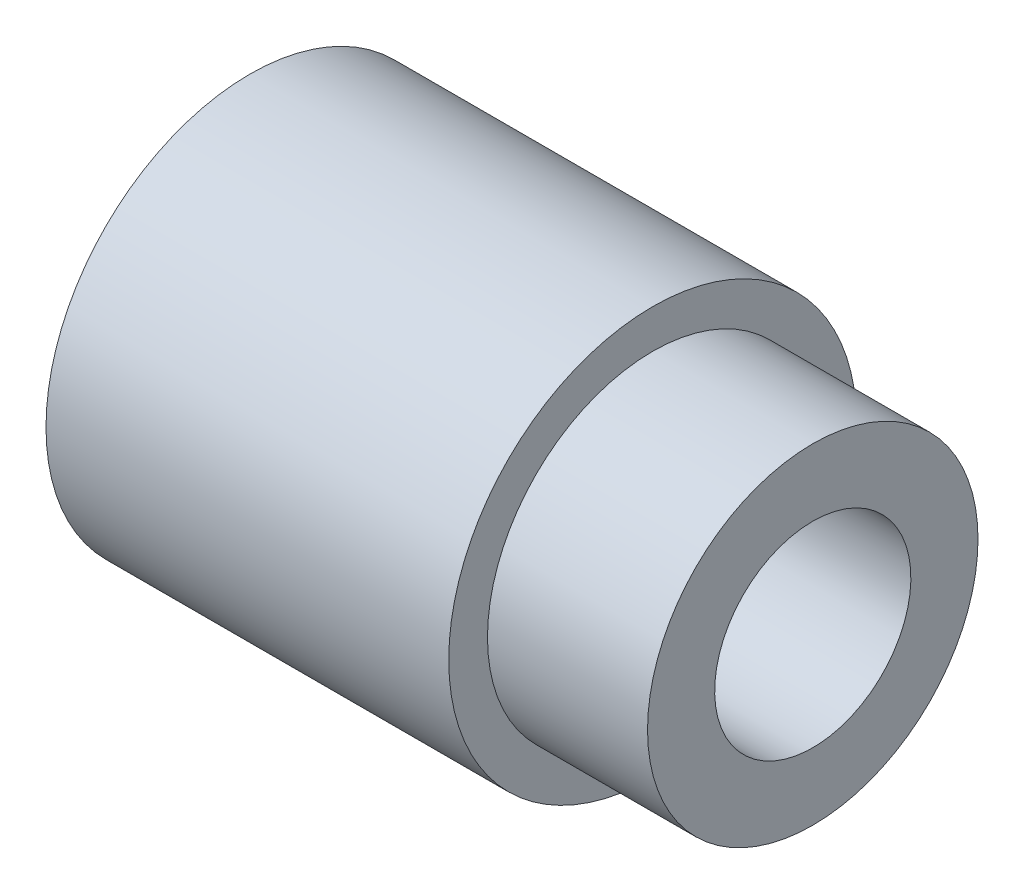
ISO-10303-21;
HEADER;
FILE_DESCRIPTION(('STEP AP214'),'2;1');
FILE_NAME('part.step','',(''),(''),'','','');
FILE_SCHEMA(('AUTOMOTIVE_DESIGN { 1 0 10303 214 1 1 1 1 }'));
ENDSEC;
DATA;
#1=APPLICATION_CONTEXT('core data for automotive mechanical design processes');
#2=APPLICATION_PROTOCOL_DEFINITION('international standard','automotive_design',2000,#1);
#3=PRODUCT_CONTEXT('',#1,'mechanical');
#4=PRODUCT('Part','Part','',(#3));
#5=PRODUCT_RELATED_PRODUCT_CATEGORY('part','',(#4));
#6=PRODUCT_DEFINITION_FORMATION('','',#4);
#7=PRODUCT_DEFINITION_CONTEXT('part definition',#1,'design');
#8=PRODUCT_DEFINITION('design','',#6,#7);
#9=PRODUCT_DEFINITION_SHAPE('','',#8);
#10=(LENGTH_UNIT() NAMED_UNIT(*) SI_UNIT(.MILLI.,.METRE.));
#11=(NAMED_UNIT(*) PLANE_ANGLE_UNIT() SI_UNIT($,.RADIAN.));
#12=(NAMED_UNIT(*) SI_UNIT($,.STERADIAN.) SOLID_ANGLE_UNIT());
#13=UNCERTAINTY_MEASURE_WITH_UNIT(LENGTH_MEASURE(1.E-05),#10,'distance_accuracy_value','');
#14=(GEOMETRIC_REPRESENTATION_CONTEXT(3) GLOBAL_UNCERTAINTY_ASSIGNED_CONTEXT((#13)) GLOBAL_UNIT_ASSIGNED_CONTEXT((#10,
#11,#12)) REPRESENTATION_CONTEXT('',''));
#15=CARTESIAN_POINT('',(0.,0.,0.));
#16=DIRECTION('',(0.,0.,1.));
#17=DIRECTION('',(1.,0.,0.));
#18=AXIS2_PLACEMENT_3D('',#15,#16,#17);
#19=CARTESIAN_POINT('',(0.,0.,0.));
#20=DIRECTION('',(1.,0.,0.));
#21=DIRECTION('',(0.,1.,0.));
#22=AXIS2_PLACEMENT_3D('',#19,#20,#21);
#23=CYLINDRICAL_SURFACE('',#22,0.95);
#24=CARTESIAN_POINT('',(-4.00985023151179,0.,0.));
#25=DIRECTION('',(-1.,0.,0.));
#26=DIRECTION('',(0.,-1.,0.));
#27=AXIS2_PLACEMENT_3D('',#24,#25,#26);
#28=CIRCLE('',#27,0.949999999988904);
#29=CARTESIAN_POINT('',(-4.00985023151179,-0.949999999988904,0.));
#30=VERTEX_POINT('',#29);
#31=EDGE_CURVE('E29',#30,#30,#28,.T.);
#32=ORIENTED_EDGE('',*,*,#31,.T.);
#33=EDGE_LOOP('',(#32));
#34=FACE_BOUND('',#33,.T.);
#35=CARTESIAN_POINT('',(0.,0.,0.));
#36=DIRECTION('',(1.,0.,0.));
#37=DIRECTION('',(0.,1.,0.));
#38=AXIS2_PLACEMENT_3D('',#35,#36,#37);
#39=CIRCLE('',#38,0.95);
#40=CARTESIAN_POINT('',(0.,0.95,0.));
#41=VERTEX_POINT('',#40);
#42=EDGE_CURVE('E17',#41,#41,#39,.F.);
#43=ORIENTED_EDGE('',*,*,#42,.F.);
#44=EDGE_LOOP('',(#43));
#45=FACE_BOUND('',#44,.T.);
#46=ADVANCED_FACE('F14',(#34,#45),#23,.F.);
#47=CARTESIAN_POINT('',(0.,0.95,0.));
#48=DIRECTION('',(1.,0.,0.));
#49=DIRECTION('',(0.,1.,0.));
#50=AXIS2_PLACEMENT_3D('',#47,#48,#49);
#51=PLANE('',#50);
#52=ORIENTED_EDGE('',*,*,#42,.T.);
#53=EDGE_LOOP('',(#52));
#54=FACE_BOUND('',#53,.T.);
#55=CARTESIAN_POINT('',(0.,0.,0.));
#56=DIRECTION('',(1.,0.,0.));
#57=DIRECTION('',(0.,1.,0.));
#58=AXIS2_PLACEMENT_3D('',#55,#56,#57);
#59=CIRCLE('',#58,1.6);
#60=CARTESIAN_POINT('',(0.,1.6,0.));
#61=VERTEX_POINT('',#60);
#62=EDGE_CURVE('E35',#61,#61,#59,.F.);
#63=ORIENTED_EDGE('',*,*,#62,.F.);
#64=EDGE_LOOP('',(#63));
#65=FACE_BOUND('',#64,.T.);
#66=ADVANCED_FACE('F45',(#54,#65),#51,.T.);
#67=CARTESIAN_POINT('',(-5.44999999993934,0.,0.));
#68=DIRECTION('',(-1.,0.,0.));
#69=DIRECTION('',(0.,0.,1.));
#70=AXIS2_PLACEMENT_3D('',#67,#68,#69);
#71=CONICAL_SURFACE('',#70,1.9500000000221,0.606938940124465);
#72=ORIENTED_EDGE('',*,*,#31,.F.);
#73=EDGE_LOOP('',(#72));
#74=FACE_BOUND('',#73,.T.);
#75=CARTESIAN_POINT('',(-5.44999999993934,0.,0.));
#76=DIRECTION('',(-1.,0.,0.));
#77=DIRECTION('',(0.,0.,1.));
#78=AXIS2_PLACEMENT_3D('',#75,#76,#77);
#79=CIRCLE('',#78,1.9500000000221);
#80=CARTESIAN_POINT('',(-5.44999999993934,0.,1.9500000000221));
#81=VERTEX_POINT('',#80);
#82=EDGE_CURVE('E33',#81,#81,#79,.F.);
#83=ORIENTED_EDGE('',*,*,#82,.F.);
#84=EDGE_LOOP('',(#83));
#85=FACE_BOUND('',#84,.T.);
#86=ADVANCED_FACE('F53',(#74,#85),#71,.F.);
#87=CARTESIAN_POINT('',(0.,0.,0.));
#88=DIRECTION('',(1.,0.,0.));
#89=DIRECTION('',(0.,1.,0.));
#90=AXIS2_PLACEMENT_3D('',#87,#88,#89);
#91=CYLINDRICAL_SURFACE('',#90,1.6);
#92=CARTESIAN_POINT('',(-1.55,0.,0.));
#93=DIRECTION('',(1.,0.,0.));
#94=DIRECTION('',(0.,1.,0.));
#95=AXIS2_PLACEMENT_3D('',#92,#93,#94);
#96=CIRCLE('',#95,1.6);
#97=CARTESIAN_POINT('',(-1.55,1.6,0.));
#98=VERTEX_POINT('',#97);
#99=EDGE_CURVE('E26',#98,#98,#96,.F.);
#100=ORIENTED_EDGE('',*,*,#99,.F.);
#101=EDGE_LOOP('',(#100));
#102=FACE_BOUND('',#101,.T.);
#103=ORIENTED_EDGE('',*,*,#62,.T.);
#104=EDGE_LOOP('',(#103));
#105=FACE_BOUND('',#104,.T.);
#106=ADVANCED_FACE('F69',(#102,#105),#91,.T.);
#107=CARTESIAN_POINT('',(-5.45,1.95,0.));
#108=DIRECTION('',(-1.,0.,0.));
#109=DIRECTION('',(0.,-1.,0.));
#110=AXIS2_PLACEMENT_3D('',#107,#108,#109);
#111=PLANE('',#110);
#112=CARTESIAN_POINT('',(-5.45,0.,0.));
#113=DIRECTION('',(1.,0.,0.));
#114=DIRECTION('',(0.,1.,0.));
#115=AXIS2_PLACEMENT_3D('',#112,#113,#114);
#116=CIRCLE('',#115,1.975);
#117=CARTESIAN_POINT('',(-5.45,1.975,0.));
#118=VERTEX_POINT('',#117);
#119=EDGE_CURVE('E21',#118,#118,#116,.T.);
#120=ORIENTED_EDGE('',*,*,#119,.F.);
#121=EDGE_LOOP('',(#120));
#122=FACE_BOUND('',#121,.T.);
#123=ORIENTED_EDGE('',*,*,#82,.T.);
#124=EDGE_LOOP('',(#123));
#125=FACE_BOUND('',#124,.T.);
#126=ADVANCED_FACE('F62',(#122,#125),#111,.T.);
#127=CARTESIAN_POINT('',(-1.55,1.6,0.));
#128=DIRECTION('',(1.,0.,0.));
#129=DIRECTION('',(0.,1.,0.));
#130=AXIS2_PLACEMENT_3D('',#127,#128,#129);
#131=PLANE('',#130);
#132=ORIENTED_EDGE('',*,*,#99,.T.);
#133=EDGE_LOOP('',(#132));
#134=FACE_BOUND('',#133,.T.);
#135=CARTESIAN_POINT('',(-1.55,0.,0.));
#136=DIRECTION('',(1.,0.,0.));
#137=DIRECTION('',(0.,1.,0.));
#138=AXIS2_PLACEMENT_3D('',#135,#136,#137);
#139=CIRCLE('',#138,1.975);
#140=CARTESIAN_POINT('',(-1.55,1.975,0.));
#141=VERTEX_POINT('',#140);
#142=EDGE_CURVE('E10',#141,#141,#139,.F.);
#143=ORIENTED_EDGE('',*,*,#142,.F.);
#144=EDGE_LOOP('',(#143));
#145=FACE_BOUND('',#144,.T.);
#146=ADVANCED_FACE('F56',(#134,#145),#131,.T.);
#147=CARTESIAN_POINT('',(0.,0.,0.));
#148=DIRECTION('',(1.,0.,0.));
#149=DIRECTION('',(0.,1.,0.));
#150=AXIS2_PLACEMENT_3D('',#147,#148,#149);
#151=CYLINDRICAL_SURFACE('',#150,1.975);
#152=ORIENTED_EDGE('',*,*,#142,.T.);
#153=EDGE_LOOP('',(#152));
#154=FACE_BOUND('',#153,.T.);
#155=ORIENTED_EDGE('',*,*,#119,.T.);
#156=EDGE_LOOP('',(#155));
#157=FACE_BOUND('',#156,.T.);
#158=ADVANCED_FACE('F54',(#154,#157),#151,.T.);
#159=CLOSED_SHELL('',(#46,#66,#86,#106,#126,#146,#158));
#160=MANIFOLD_SOLID_BREP('B1',#159);
#161=ADVANCED_BREP_SHAPE_REPRESENTATION('',(#18,#160),#14);
#162=SHAPE_DEFINITION_REPRESENTATION(#9,#161);
ENDSEC;
END-ISO-10303-21;
